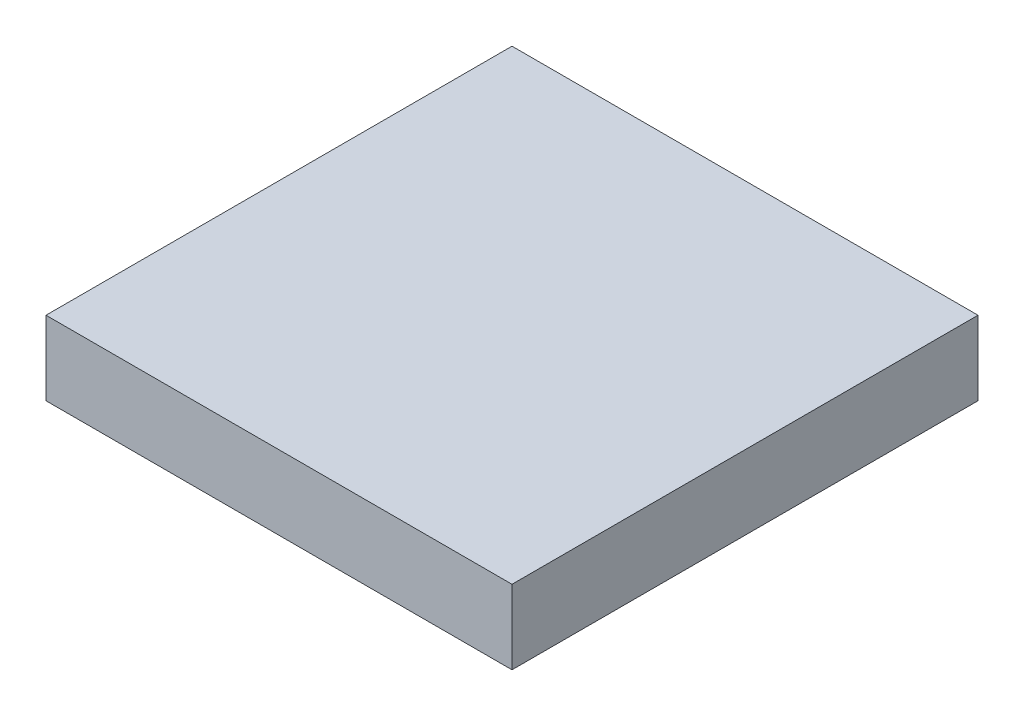
ISO-10303-21;
HEADER;
FILE_DESCRIPTION(('STEP AP214'),'2;1');
FILE_NAME('part.step','',(''),(''),'','','');
FILE_SCHEMA(('AUTOMOTIVE_DESIGN { 1 0 10303 214 1 1 1 1 }'));
ENDSEC;
DATA;
#1=APPLICATION_CONTEXT('core data for automotive mechanical design processes');
#2=APPLICATION_PROTOCOL_DEFINITION('international standard','automotive_design',2000,#1);
#3=PRODUCT_CONTEXT('',#1,'mechanical');
#4=PRODUCT('Part','Part','',(#3));
#5=PRODUCT_RELATED_PRODUCT_CATEGORY('part','',(#4));
#6=PRODUCT_DEFINITION_FORMATION('','',#4);
#7=PRODUCT_DEFINITION_CONTEXT('part definition',#1,'design');
#8=PRODUCT_DEFINITION('design','',#6,#7);
#9=PRODUCT_DEFINITION_SHAPE('','',#8);
#10=(LENGTH_UNIT() NAMED_UNIT(*) SI_UNIT(.MILLI.,.METRE.));
#11=(NAMED_UNIT(*) PLANE_ANGLE_UNIT() SI_UNIT($,.RADIAN.));
#12=(NAMED_UNIT(*) SI_UNIT($,.STERADIAN.) SOLID_ANGLE_UNIT());
#13=UNCERTAINTY_MEASURE_WITH_UNIT(LENGTH_MEASURE(1.E-05),#10,'distance_accuracy_value','');
#14=(GEOMETRIC_REPRESENTATION_CONTEXT(3) GLOBAL_UNCERTAINTY_ASSIGNED_CONTEXT((#13)) GLOBAL_UNIT_ASSIGNED_CONTEXT((#10,
#11,#12)) REPRESENTATION_CONTEXT('',''));
#15=CARTESIAN_POINT('',(0.,0.,0.));
#16=DIRECTION('',(0.,0.,1.));
#17=DIRECTION('',(1.,0.,0.));
#18=AXIS2_PLACEMENT_3D('',#15,#16,#17);
#19=CARTESIAN_POINT('',(0.,1.59,0.));
#20=DIRECTION('',(1.,0.,0.));
#21=DIRECTION('',(0.,0.,-1.));
#22=AXIS2_PLACEMENT_3D('',#19,#20,#21);
#23=PLANE('',#22);
#24=DIRECTION('',(0.,0.,1.));
#25=VECTOR('',#24,1.);
#26=CARTESIAN_POINT('',(0.,0.,0.));
#27=LINE('',#26,#25);
#28=CARTESIAN_POINT('',(0.,0.,-9.99999999999999));
#29=VERTEX_POINT('',#28);
#30=CARTESIAN_POINT('',(0.,0.,0.));
#31=VERTEX_POINT('',#30);
#32=EDGE_CURVE('E100',#29,#31,#27,.T.);
#33=ORIENTED_EDGE('',*,*,#32,.T.);
#34=DIRECTION('',(0.,-1.,0.));
#35=VECTOR('',#34,1.);
#36=CARTESIAN_POINT('',(0.,1.59,0.));
#37=LINE('',#36,#35);
#38=CARTESIAN_POINT('',(0.,1.59,0.));
#39=VERTEX_POINT('',#38);
#40=EDGE_CURVE('E11',#39,#31,#37,.T.);
#41=ORIENTED_EDGE('',*,*,#40,.F.);
#42=DIRECTION('',(0.,0.,1.));
#43=VECTOR('',#42,1.);
#44=CARTESIAN_POINT('',(0.,1.59,0.));
#45=LINE('',#44,#43);
#46=CARTESIAN_POINT('',(0.,1.59,-9.99999999999999));
#47=VERTEX_POINT('',#46);
#48=EDGE_CURVE('E88',#47,#39,#45,.T.);
#49=ORIENTED_EDGE('',*,*,#48,.F.);
#50=DIRECTION('',(0.,-1.,0.));
#51=VECTOR('',#50,1.);
#52=CARTESIAN_POINT('',(0.,1.59,-9.99999999999999));
#53=LINE('',#52,#51);
#54=EDGE_CURVE('E96',#47,#29,#53,.T.);
#55=ORIENTED_EDGE('',*,*,#54,.T.);
#56=EDGE_LOOP('',(#33,#41,#49,#55));
#57=FACE_BOUND('',#56,.T.);
#58=ADVANCED_FACE('F37',(#57),#23,.F.);
#59=CARTESIAN_POINT('',(0.,1.59,0.));
#60=DIRECTION('',(0.,0.,-1.));
#61=DIRECTION('',(-1.,0.,0.));
#62=AXIS2_PLACEMENT_3D('',#59,#60,#61);
#63=PLANE('',#62);
#64=DIRECTION('',(1.,0.,0.));
#65=VECTOR('',#64,1.);
#66=CARTESIAN_POINT('',(0.,0.,0.));
#67=LINE('',#66,#65);
#68=CARTESIAN_POINT('',(10.,0.,0.));
#69=VERTEX_POINT('',#68);
#70=EDGE_CURVE('E92',#31,#69,#67,.T.);
#71=ORIENTED_EDGE('',*,*,#70,.T.);
#72=DIRECTION('',(0.,-1.,0.));
#73=VECTOR('',#72,1.);
#74=CARTESIAN_POINT('',(10.,1.59,0.));
#75=LINE('',#74,#73);
#76=CARTESIAN_POINT('',(10.,1.59,0.));
#77=VERTEX_POINT('',#76);
#78=EDGE_CURVE('E45',#77,#69,#75,.T.);
#79=ORIENTED_EDGE('',*,*,#78,.F.);
#80=DIRECTION('',(1.,0.,0.));
#81=VECTOR('',#80,1.);
#82=CARTESIAN_POINT('',(0.,1.59,0.));
#83=LINE('',#82,#81);
#84=EDGE_CURVE('E83',#39,#77,#83,.T.);
#85=ORIENTED_EDGE('',*,*,#84,.F.);
#86=ORIENTED_EDGE('',*,*,#40,.T.);
#87=EDGE_LOOP('',(#71,#79,#85,#86));
#88=FACE_BOUND('',#87,.T.);
#89=ADVANCED_FACE('F91',(#88),#63,.F.);
#90=CARTESIAN_POINT('',(10.,1.59,0.));
#91=DIRECTION('',(-1.,0.,0.));
#92=DIRECTION('',(0.,0.,1.));
#93=AXIS2_PLACEMENT_3D('',#90,#91,#92);
#94=PLANE('',#93);
#95=DIRECTION('',(0.,0.,-1.));
#96=VECTOR('',#95,1.);
#97=CARTESIAN_POINT('',(10.,0.,0.));
#98=LINE('',#97,#96);
#99=CARTESIAN_POINT('',(10.,0.,-9.99999999999999));
#100=VERTEX_POINT('',#99);
#101=EDGE_CURVE('E70',#69,#100,#98,.T.);
#102=ORIENTED_EDGE('',*,*,#101,.T.);
#103=DIRECTION('',(0.,-1.,0.));
#104=VECTOR('',#103,1.);
#105=CARTESIAN_POINT('',(10.,1.59,-9.99999999999999));
#106=LINE('',#105,#104);
#107=CARTESIAN_POINT('',(10.,1.59,-9.99999999999999));
#108=VERTEX_POINT('',#107);
#109=EDGE_CURVE('E93',#108,#100,#106,.T.);
#110=ORIENTED_EDGE('',*,*,#109,.F.);
#111=DIRECTION('',(0.,0.,-1.));
#112=VECTOR('',#111,1.);
#113=CARTESIAN_POINT('',(10.,1.59,0.));
#114=LINE('',#113,#112);
#115=EDGE_CURVE('E86',#77,#108,#114,.T.);
#116=ORIENTED_EDGE('',*,*,#115,.F.);
#117=ORIENTED_EDGE('',*,*,#78,.T.);
#118=EDGE_LOOP('',(#102,#110,#116,#117));
#119=FACE_BOUND('',#118,.T.);
#120=ADVANCED_FACE('F94',(#119),#94,.F.);
#121=CARTESIAN_POINT('',(0.,1.59,-9.99999999999999));
#122=DIRECTION('',(0.,0.,1.));
#123=DIRECTION('',(1.,0.,0.));
#124=AXIS2_PLACEMENT_3D('',#121,#122,#123);
#125=PLANE('',#124);
#126=DIRECTION('',(-1.,0.,0.));
#127=VECTOR('',#126,1.);
#128=CARTESIAN_POINT('',(0.,0.,-9.99999999999999));
#129=LINE('',#128,#127);
#130=EDGE_CURVE('E76',#100,#29,#129,.T.);
#131=ORIENTED_EDGE('',*,*,#130,.T.);
#132=ORIENTED_EDGE('',*,*,#54,.F.);
#133=DIRECTION('',(-1.,0.,0.));
#134=VECTOR('',#133,1.);
#135=CARTESIAN_POINT('',(0.,1.59,-9.99999999999999));
#136=LINE('',#135,#134);
#137=EDGE_CURVE('E53',#108,#47,#136,.T.);
#138=ORIENTED_EDGE('',*,*,#137,.F.);
#139=ORIENTED_EDGE('',*,*,#109,.T.);
#140=EDGE_LOOP('',(#131,#132,#138,#139));
#141=FACE_BOUND('',#140,.T.);
#142=ADVANCED_FACE('F107',(#141),#125,.F.);
#143=CARTESIAN_POINT('',(0.,1.59,0.));
#144=DIRECTION('',(0.,-1.,0.));
#145=DIRECTION('',(0.,0.,-1.));
#146=AXIS2_PLACEMENT_3D('',#143,#144,#145);
#147=PLANE('',#146);
#148=ORIENTED_EDGE('',*,*,#48,.T.);
#149=ORIENTED_EDGE('',*,*,#84,.T.);
#150=ORIENTED_EDGE('',*,*,#115,.T.);
#151=ORIENTED_EDGE('',*,*,#137,.T.);
#152=EDGE_LOOP('',(#148,#149,#150,#151));
#153=FACE_BOUND('',#152,.T.);
#154=ADVANCED_FACE('F84',(#153),#147,.F.);
#155=CARTESIAN_POINT('',(0.,0.,0.));
#156=DIRECTION('',(0.,-1.,0.));
#157=DIRECTION('',(0.,0.,-1.));
#158=AXIS2_PLACEMENT_3D('',#155,#156,#157);
#159=PLANE('',#158);
#160=ORIENTED_EDGE('',*,*,#32,.F.);
#161=ORIENTED_EDGE('',*,*,#130,.F.);
#162=ORIENTED_EDGE('',*,*,#101,.F.);
#163=ORIENTED_EDGE('',*,*,#70,.F.);
#164=EDGE_LOOP('',(#160,#161,#162,#163));
#165=FACE_BOUND('',#164,.T.);
#166=ADVANCED_FACE('F110',(#165),#159,.T.);
#167=CLOSED_SHELL('',(#58,#89,#120,#142,#154,#166));
#168=MANIFOLD_SOLID_BREP('B2',#167);
#169=ADVANCED_BREP_SHAPE_REPRESENTATION('',(#18,#168),#14);
#170=SHAPE_DEFINITION_REPRESENTATION(#9,#169);
ENDSEC;
END-ISO-10303-21;
